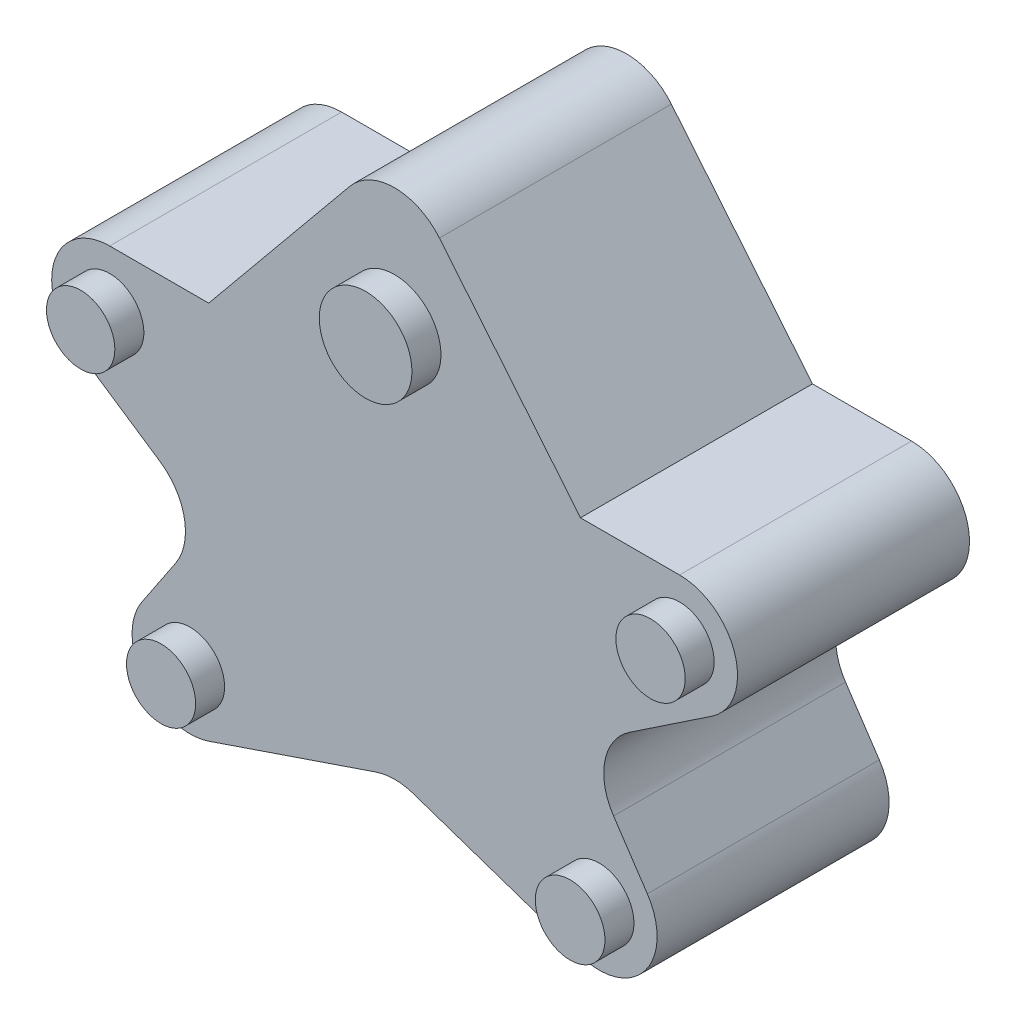
ISO-10303-21;
HEADER;
FILE_DESCRIPTION(('STEP AP214'),'2;1');
FILE_NAME('part.step','',(''),(''),'','','');
FILE_SCHEMA(('AUTOMOTIVE_DESIGN { 1 0 10303 214 1 1 1 1 }'));
ENDSEC;
DATA;
#1=APPLICATION_CONTEXT('core data for automotive mechanical design processes');
#2=APPLICATION_PROTOCOL_DEFINITION('international standard','automotive_design',2000,#1);
#3=PRODUCT_CONTEXT('',#1,'mechanical');
#4=PRODUCT('Part','Part','',(#3));
#5=PRODUCT_RELATED_PRODUCT_CATEGORY('part','',(#4));
#6=PRODUCT_DEFINITION_FORMATION('','',#4);
#7=PRODUCT_DEFINITION_CONTEXT('part definition',#1,'design');
#8=PRODUCT_DEFINITION('design','',#6,#7);
#9=PRODUCT_DEFINITION_SHAPE('','',#8);
#10=(LENGTH_UNIT() NAMED_UNIT(*) SI_UNIT(.MILLI.,.METRE.));
#11=(NAMED_UNIT(*) PLANE_ANGLE_UNIT() SI_UNIT($,.RADIAN.));
#12=(NAMED_UNIT(*) SI_UNIT($,.STERADIAN.) SOLID_ANGLE_UNIT());
#13=UNCERTAINTY_MEASURE_WITH_UNIT(LENGTH_MEASURE(1.E-05),#10,'distance_accuracy_value','');
#14=(GEOMETRIC_REPRESENTATION_CONTEXT(3) GLOBAL_UNCERTAINTY_ASSIGNED_CONTEXT((#13)) GLOBAL_UNIT_ASSIGNED_CONTEXT((#10,
#11,#12)) REPRESENTATION_CONTEXT('',''));
#15=CARTESIAN_POINT('',(0.,0.,0.));
#16=DIRECTION('',(0.,0.,1.));
#17=DIRECTION('',(1.,0.,0.));
#18=AXIS2_PLACEMENT_3D('',#15,#16,#17);
#19=CARTESIAN_POINT('',(10.1618807837349,60.5263157894737,40.));
#20=DIRECTION('',(0.556141389240398,0.831087694033404,0.));
#21=DIRECTION('',(-0.831087694033404,0.556141389240398,0.));
#22=AXIS2_PLACEMENT_3D('',#19,#20,#21);
#23=PLANE('',#22);
#24=DIRECTION('',(0.831087694033404,-0.556141389240398,0.));
#25=VECTOR('',#24,1.);
#26=CARTESIAN_POINT('',(10.1618807837349,60.5263157894737,0.));
#27=LINE('',#26,#25);
#28=CARTESIAN_POINT('',(37.5253260990655,42.2154388491397,0.));
#29=VERTEX_POINT('',#28);
#30=CARTESIAN_POINT('',(51.716265485405,32.7192463274538,0.));
#31=VERTEX_POINT('',#30);
#32=EDGE_CURVE('E205',#29,#31,#27,.T.);
#33=ORIENTED_EDGE('',*,*,#32,.T.);
#34=DIRECTION('',(0.,0.,-1.));
#35=VECTOR('',#34,1.);
#36=CARTESIAN_POINT('',(51.716265485405,32.7192463274538,40.));
#37=LINE('',#36,#35);
#38=CARTESIAN_POINT('',(51.716265485405,32.7192463274538,40.));
#39=VERTEX_POINT('',#38);
#40=EDGE_CURVE('E241',#31,#39,#37,.F.);
#41=ORIENTED_EDGE('',*,*,#40,.T.);
#42=DIRECTION('',(0.831087694033404,-0.556141389240398,0.));
#43=VECTOR('',#42,1.);
#44=CARTESIAN_POINT('',(10.1618807837349,60.5263157894737,40.));
#45=LINE('',#44,#43);
#46=CARTESIAN_POINT('',(37.5253260990655,42.2154388491397,40.));
#47=VERTEX_POINT('',#46);
#48=EDGE_CURVE('E231',#47,#39,#45,.T.);
#49=ORIENTED_EDGE('',*,*,#48,.F.);
#50=DIRECTION('',(0.,0.,-1.));
#51=VECTOR('',#50,1.);
#52=CARTESIAN_POINT('',(37.5253260990655,42.2154388491397,40.));
#53=LINE('',#52,#51);
#54=EDGE_CURVE('E238',#47,#29,#53,.T.);
#55=ORIENTED_EDGE('',*,*,#54,.T.);
#56=EDGE_LOOP('',(#33,#41,#49,#55));
#57=FACE_BOUND('',#56,.T.);
#58=ADVANCED_FACE('F44',(#57),#23,.F.);
#59=CARTESIAN_POINT('',(60.0271424257391,27.1578324350498,40.));
#60=DIRECTION('',(0.831087694033403,-0.556141389240398,0.));
#61=DIRECTION('',(0.556141389240398,0.831087694033403,0.));
#62=AXIS2_PLACEMENT_3D('',#59,#60,#61);
#63=PLANE('',#62);
#64=DIRECTION('',(-0.556141389240398,-0.831087694033403,0.));
#65=VECTOR('',#64,1.);
#66=CARTESIAN_POINT('',(60.0271424257391,27.1578324350498,40.));
#67=LINE('',#66,#65);
#68=CARTESIAN_POINT('',(54.4657285333351,18.8469554947158,40.));
#69=VERTEX_POINT('',#68);
#70=CARTESIAN_POINT('',(48.6398607519713,10.1408834169474,40.));
#71=VERTEX_POINT('',#70);
#72=EDGE_CURVE('E383',#69,#71,#67,.T.);
#73=ORIENTED_EDGE('',*,*,#72,.F.);
#74=DIRECTION('',(0.,0.,-1.));
#75=VECTOR('',#74,1.);
#76=CARTESIAN_POINT('',(54.4657285333351,18.8469554947158,0.));
#77=LINE('',#76,#75);
#78=CARTESIAN_POINT('',(54.4657285333351,18.8469554947158,0.));
#79=VERTEX_POINT('',#78);
#80=EDGE_CURVE('E235',#69,#79,#77,.T.);
#81=ORIENTED_EDGE('',*,*,#80,.T.);
#82=DIRECTION('',(-0.556141389240398,-0.831087694033403,0.));
#83=VECTOR('',#82,1.);
#84=CARTESIAN_POINT('',(60.0271424257391,27.1578324350498,0.));
#85=LINE('',#84,#83);
#86=CARTESIAN_POINT('',(48.6398607519713,10.1408834169474,0.));
#87=VERTEX_POINT('',#86);
#88=EDGE_CURVE('E208',#79,#87,#85,.T.);
#89=ORIENTED_EDGE('',*,*,#88,.T.);
#90=DIRECTION('',(0.,0.,-1.));
#91=VECTOR('',#90,1.);
#92=CARTESIAN_POINT('',(48.6398607519713,10.1408834169474,40.));
#93=LINE('',#92,#91);
#94=EDGE_CURVE('E192',#87,#71,#93,.F.);
#95=ORIENTED_EDGE('',*,*,#94,.T.);
#96=EDGE_LOOP('',(#73,#81,#89,#95));
#97=FACE_BOUND('',#96,.T.);
#98=ADVANCED_FACE('F340',(#97),#63,.F.);
#99=CARTESIAN_POINT('',(32.2200729637191,-14.3965522666203,40.));
#100=DIRECTION('',(-0.322066650937309,0.946716996971125,0.));
#101=DIRECTION('',(-0.946716996971125,-0.322066650937309,0.));
#102=AXIS2_PLACEMENT_3D('',#99,#100,#101);
#103=PLANE('',#102);
#104=DIRECTION('',(0.946716996971125,0.322066650937309,0.));
#105=VECTOR('',#104,1.);
#106=CARTESIAN_POINT('',(32.2200729637191,-14.3965522666203,0.));
#107=LINE('',#106,#105);
#108=CARTESIAN_POINT('',(60.1714042016784,-4.88770044516783,0.));
#109=VERTEX_POINT('',#108);
#110=CARTESIAN_POINT('',(88.9994064543461,4.91938886286649,0.));
#111=VERTEX_POINT('',#110);
#112=EDGE_CURVE('E212',#109,#111,#107,.T.);
#113=ORIENTED_EDGE('',*,*,#112,.T.);
#114=DIRECTION('',(0.,0.,-1.));
#115=VECTOR('',#114,1.);
#116=CARTESIAN_POINT('',(88.999406454346,4.91938886286649,40.));
#117=LINE('',#116,#115);
#118=CARTESIAN_POINT('',(88.9994064543461,4.91938886286649,40.));
#119=VERTEX_POINT('',#118);
#120=EDGE_CURVE('E279',#111,#119,#117,.F.);
#121=ORIENTED_EDGE('',*,*,#120,.T.);
#122=DIRECTION('',(0.946716996971125,0.322066650937309,0.));
#123=VECTOR('',#122,1.);
#124=CARTESIAN_POINT('',(32.2200729637191,-14.3965522666203,40.));
#125=LINE('',#124,#123);
#126=CARTESIAN_POINT('',(60.1714042016784,-4.88770044516783,40.));
#127=VERTEX_POINT('',#126);
#128=EDGE_CURVE('E386',#127,#119,#125,.T.);
#129=ORIENTED_EDGE('',*,*,#128,.F.);
#130=DIRECTION('',(0.,0.,-1.));
#131=VECTOR('',#130,1.);
#132=CARTESIAN_POINT('',(60.1714042016784,-4.88770044516783,40.));
#133=LINE('',#132,#131);
#134=EDGE_CURVE('E276',#127,#109,#133,.T.);
#135=ORIENTED_EDGE('',*,*,#134,.T.);
#136=EDGE_LOOP('',(#113,#121,#129,#135));
#137=FACE_BOUND('',#136,.T.);
#138=ADVANCED_FACE('F345',(#137),#103,.F.);
#139=CARTESIAN_POINT('',(152.220072963719,-14.3965522666202,40.));
#140=DIRECTION('',(0.322066650937308,0.946716996971126,0.));
#141=DIRECTION('',(-0.946716996971126,0.322066650937308,0.));
#142=AXIS2_PLACEMENT_3D('',#139,#140,#141);
#143=PLANE('',#142);
#144=DIRECTION('',(0.946716996971126,-0.322066650937308,0.));
#145=VECTOR('',#144,1.);
#146=CARTESIAN_POINT('',(152.220072963719,-14.3965522666202,0.));
#147=LINE('',#146,#145);
#148=CARTESIAN_POINT('',(95.4407394730922,4.9193888628665,0.));
#149=VERTEX_POINT('',#148);
#150=CARTESIAN_POINT('',(124.26874172576,-4.8877004451678,0.));
#151=VERTEX_POINT('',#150);
#152=EDGE_CURVE('E215',#149,#151,#147,.T.);
#153=ORIENTED_EDGE('',*,*,#152,.T.);
#154=DIRECTION('',(0.,0.,-1.));
#155=VECTOR('',#154,1.);
#156=CARTESIAN_POINT('',(124.26874172576,-4.8877004451678,40.));
#157=LINE('',#156,#155);
#158=CARTESIAN_POINT('',(124.26874172576,-4.8877004451678,40.));
#159=VERTEX_POINT('',#158);
#160=EDGE_CURVE('E266',#151,#159,#157,.F.);
#161=ORIENTED_EDGE('',*,*,#160,.T.);
#162=DIRECTION('',(0.946716996971126,-0.322066650937308,0.));
#163=VECTOR('',#162,1.);
#164=CARTESIAN_POINT('',(152.220072963719,-14.3965522666202,40.));
#165=LINE('',#164,#163);
#166=CARTESIAN_POINT('',(95.4407394730922,4.9193888628665,40.));
#167=VERTEX_POINT('',#166);
#168=EDGE_CURVE('E393',#167,#159,#165,.T.);
#169=ORIENTED_EDGE('',*,*,#168,.F.);
#170=DIRECTION('',(0.,0.,-1.));
#171=VECTOR('',#170,1.);
#172=CARTESIAN_POINT('',(95.4407394730922,4.91938886286649,0.));
#173=LINE('',#172,#171);
#174=EDGE_CURVE('E263',#167,#149,#173,.T.);
#175=ORIENTED_EDGE('',*,*,#174,.T.);
#176=EDGE_LOOP('',(#153,#161,#169,#175));
#177=FACE_BOUND('',#176,.T.);
#178=ADVANCED_FACE('F428',(#177),#143,.F.);
#179=CARTESIAN_POINT('',(124.413003501699,27.1578324350499,40.));
#180=DIRECTION('',(-0.831087694033403,-0.556141389240399,0.));
#181=DIRECTION('',(0.556141389240399,-0.831087694033403,0.));
#182=AXIS2_PLACEMENT_3D('',#179,#180,#181);
#183=PLANE('',#182);
#184=DIRECTION('',(-0.556141389240399,0.831087694033403,0.));
#185=VECTOR('',#184,1.);
#186=CARTESIAN_POINT('',(124.413003501699,27.1578324350499,0.));
#187=LINE('',#186,#185);
#188=CARTESIAN_POINT('',(135.800285175467,10.1408834169474,0.));
#189=VERTEX_POINT('',#188);
#190=CARTESIAN_POINT('',(129.974417394103,18.8469554947159,0.));
#191=VERTEX_POINT('',#190);
#192=EDGE_CURVE('E218',#189,#191,#187,.T.);
#193=ORIENTED_EDGE('',*,*,#192,.T.);
#194=DIRECTION('',(0.,0.,-1.));
#195=VECTOR('',#194,1.);
#196=CARTESIAN_POINT('',(129.974417394103,18.8469554947158,40.));
#197=LINE('',#196,#195);
#198=CARTESIAN_POINT('',(129.974417394103,18.8469554947159,40.));
#199=VERTEX_POINT('',#198);
#200=EDGE_CURVE('E251',#191,#199,#197,.F.);
#201=ORIENTED_EDGE('',*,*,#200,.T.);
#202=DIRECTION('',(-0.556141389240399,0.831087694033403,0.));
#203=VECTOR('',#202,1.);
#204=CARTESIAN_POINT('',(124.413003501699,27.1578324350499,40.));
#205=LINE('',#204,#203);
#206=CARTESIAN_POINT('',(135.800285175467,10.1408834169474,40.));
#207=VERTEX_POINT('',#206);
#208=EDGE_CURVE('E395',#207,#199,#205,.T.);
#209=ORIENTED_EDGE('',*,*,#208,.F.);
#210=DIRECTION('',(0.,0.,-1.));
#211=VECTOR('',#210,1.);
#212=CARTESIAN_POINT('',(135.800285175467,10.1408834169474,40.));
#213=LINE('',#212,#211);
#214=EDGE_CURVE('E248',#207,#189,#213,.T.);
#215=ORIENTED_EDGE('',*,*,#214,.T.);
#216=EDGE_LOOP('',(#193,#201,#209,#215));
#217=FACE_BOUND('',#216,.T.);
#218=ADVANCED_FACE('F425',(#217),#183,.F.);
#219=CARTESIAN_POINT('',(174.278265143703,60.5263157894737,40.));
#220=DIRECTION('',(-0.556141389240398,0.831087694033404,0.));
#221=DIRECTION('',(-0.831087694033404,-0.556141389240398,0.));
#222=AXIS2_PLACEMENT_3D('',#219,#220,#221);
#223=PLANE('',#222);
#224=DIRECTION('',(0.831087694033404,0.556141389240398,0.));
#225=VECTOR('',#224,1.);
#226=CARTESIAN_POINT('',(174.278265143703,60.5263157894737,40.));
#227=LINE('',#226,#225);
#228=CARTESIAN_POINT('',(132.723880442033,32.7192463274539,40.));
#229=VERTEX_POINT('',#228);
#230=CARTESIAN_POINT('',(146.914819828373,42.2154388491397,40.));
#231=VERTEX_POINT('',#230);
#232=EDGE_CURVE('E182',#229,#231,#227,.T.);
#233=ORIENTED_EDGE('',*,*,#232,.F.);
#234=DIRECTION('',(0.,0.,-1.));
#235=VECTOR('',#234,1.);
#236=CARTESIAN_POINT('',(132.723880442033,32.7192463274539,0.));
#237=LINE('',#236,#235);
#238=CARTESIAN_POINT('',(132.723880442033,32.7192463274539,0.));
#239=VERTEX_POINT('',#238);
#240=EDGE_CURVE('E245',#229,#239,#237,.T.);
#241=ORIENTED_EDGE('',*,*,#240,.T.);
#242=DIRECTION('',(0.831087694033404,0.556141389240398,0.));
#243=VECTOR('',#242,1.);
#244=CARTESIAN_POINT('',(174.278265143703,60.5263157894737,0.));
#245=LINE('',#244,#243);
#246=CARTESIAN_POINT('',(146.914819828373,42.2154388491397,0.));
#247=VERTEX_POINT('',#246);
#248=EDGE_CURVE('E221',#239,#247,#245,.T.);
#249=ORIENTED_EDGE('',*,*,#248,.T.);
#250=DIRECTION('',(0.,0.,-1.));
#251=VECTOR('',#250,1.);
#252=CARTESIAN_POINT('',(146.914819828373,42.2154388491397,40.));
#253=LINE('',#252,#251);
#254=EDGE_CURVE('E243',#247,#231,#253,.F.);
#255=ORIENTED_EDGE('',*,*,#254,.T.);
#256=EDGE_LOOP('',(#233,#241,#249,#255));
#257=FACE_BOUND('',#256,.T.);
#258=ADVANCED_FACE('F422',(#257),#223,.F.);
#259=CARTESIAN_POINT('',(174.278265143703,60.5263157894737,40.));
#260=DIRECTION('',(0.,-1.,0.));
#261=DIRECTION('',(0.,0.,-1.));
#262=AXIS2_PLACEMENT_3D('',#259,#260,#261);
#263=PLANE('',#262);
#264=DIRECTION('',(-1.,0.,0.));
#265=VECTOR('',#264,1.);
#266=CARTESIAN_POINT('',(174.278265143703,60.5263157894737,40.));
#267=LINE('',#266,#265);
#268=CARTESIAN_POINT('',(141.353405935969,60.5263157894737,40.));
#269=VERTEX_POINT('',#268);
#270=CARTESIAN_POINT('',(124.278265143703,60.5263157894737,40.));
#271=VERTEX_POINT('',#270);
#272=EDGE_CURVE('E170',#269,#271,#267,.T.);
#273=ORIENTED_EDGE('',*,*,#272,.F.);
#274=DIRECTION('',(0.,0.,-1.));
#275=VECTOR('',#274,1.);
#276=CARTESIAN_POINT('',(141.353405935969,60.5263157894737,40.));
#277=LINE('',#276,#275);
#278=CARTESIAN_POINT('',(141.353405935969,60.5263157894737,0.));
#279=VERTEX_POINT('',#278);
#280=EDGE_CURVE('E286',#269,#279,#277,.T.);
#281=ORIENTED_EDGE('',*,*,#280,.T.);
#282=DIRECTION('',(-1.,0.,0.));
#283=VECTOR('',#282,1.);
#284=CARTESIAN_POINT('',(174.278265143703,60.5263157894737,0.));
#285=LINE('',#284,#283);
#286=CARTESIAN_POINT('',(124.278265143703,60.5263157894737,0.));
#287=VERTEX_POINT('',#286);
#288=EDGE_CURVE('E188',#279,#287,#285,.T.);
#289=ORIENTED_EDGE('',*,*,#288,.T.);
#290=DIRECTION('',(0.,0.,-1.));
#291=VECTOR('',#290,1.);
#292=CARTESIAN_POINT('',(124.278265143703,60.5263157894737,40.));
#293=LINE('',#292,#291);
#294=EDGE_CURVE('E185',#271,#287,#293,.T.);
#295=ORIENTED_EDGE('',*,*,#294,.F.);
#296=EDGE_LOOP('',(#273,#281,#289,#295));
#297=FACE_BOUND('',#296,.T.);
#298=ADVANCED_FACE('F186',(#297),#263,.F.);
#299=CARTESIAN_POINT('',(124.278265143703,60.5263157894737,40.));
#300=DIRECTION('',(-0.772612302711674,-0.634878121924645,0.));
#301=DIRECTION('',(0.634878121924645,-0.772612302711674,0.));
#302=AXIS2_PLACEMENT_3D('',#299,#300,#301);
#303=PLANE('',#302);
#304=DIRECTION('',(-0.634878121924645,0.772612302711674,0.));
#305=VECTOR('',#304,1.);
#306=CARTESIAN_POINT('',(124.278265143703,60.5263157894737,0.));
#307=LINE('',#306,#305);
#308=CARTESIAN_POINT('',(99.9461959908359,90.1371266344693,0.));
#309=VERTEX_POINT('',#308);
#310=EDGE_CURVE('E225',#287,#309,#307,.T.);
#311=ORIENTED_EDGE('',*,*,#310,.T.);
#312=DIRECTION('',(0.,0.,-1.));
#313=VECTOR('',#312,1.);
#314=CARTESIAN_POINT('',(99.9461959908359,90.1371266344693,40.));
#315=LINE('',#314,#313);
#316=CARTESIAN_POINT('',(99.9461959908359,90.1371266344693,40.));
#317=VERTEX_POINT('',#316);
#318=EDGE_CURVE('E197',#309,#317,#315,.F.);
#319=ORIENTED_EDGE('',*,*,#318,.T.);
#320=DIRECTION('',(-0.634878121924645,0.772612302711674,0.));
#321=VECTOR('',#320,1.);
#322=CARTESIAN_POINT('',(124.278265143703,60.5263157894737,40.));
#323=LINE('',#322,#321);
#324=EDGE_CURVE('E175',#271,#317,#323,.T.);
#325=ORIENTED_EDGE('',*,*,#324,.F.);
#326=ORIENTED_EDGE('',*,*,#294,.T.);
#327=EDGE_LOOP('',(#311,#319,#325,#326));
#328=FACE_BOUND('',#327,.T.);
#329=ADVANCED_FACE('F195',(#328),#303,.F.);
#330=CARTESIAN_POINT('',(60.1618807837349,60.5263157894737,40.));
#331=DIRECTION('',(0.772612302711674,-0.634878121924645,0.));
#332=DIRECTION('',(0.634878121924645,0.772612302711675,0.));
#333=AXIS2_PLACEMENT_3D('',#330,#331,#332);
#334=PLANE('',#333);
#335=DIRECTION('',(-0.634878121924645,-0.772612302711674,0.));
#336=VECTOR('',#335,1.);
#337=CARTESIAN_POINT('',(60.1618807837349,60.5263157894737,40.));
#338=LINE('',#337,#336);
#339=CARTESIAN_POINT('',(84.4939499366024,90.1371266344693,40.));
#340=VERTEX_POINT('',#339);
#341=CARTESIAN_POINT('',(60.1618807837349,60.5263157894737,40.));
#342=VERTEX_POINT('',#341);
#343=EDGE_CURVE('E198',#340,#342,#338,.T.);
#344=ORIENTED_EDGE('',*,*,#343,.F.);
#345=DIRECTION('',(0.,0.,-1.));
#346=VECTOR('',#345,1.);
#347=CARTESIAN_POINT('',(84.4939499366024,90.1371266344693,40.));
#348=LINE('',#347,#346);
#349=CARTESIAN_POINT('',(84.4939499366024,90.1371266344693,0.));
#350=VERTEX_POINT('',#349);
#351=EDGE_CURVE('E281',#340,#350,#348,.T.);
#352=ORIENTED_EDGE('',*,*,#351,.T.);
#353=DIRECTION('',(-0.634878121924645,-0.772612302711674,0.));
#354=VECTOR('',#353,1.);
#355=CARTESIAN_POINT('',(60.1618807837349,60.5263157894737,0.));
#356=LINE('',#355,#354);
#357=CARTESIAN_POINT('',(60.1618807837349,60.5263157894737,0.));
#358=VERTEX_POINT('',#357);
#359=EDGE_CURVE('E227',#350,#358,#356,.T.);
#360=ORIENTED_EDGE('',*,*,#359,.T.);
#361=DIRECTION('',(0.,0.,-1.));
#362=VECTOR('',#361,1.);
#363=CARTESIAN_POINT('',(60.1618807837349,60.5263157894737,40.));
#364=LINE('',#363,#362);
#365=EDGE_CURVE('E193',#342,#358,#364,.T.);
#366=ORIENTED_EDGE('',*,*,#365,.F.);
#367=EDGE_LOOP('',(#344,#352,#360,#366));
#368=FACE_BOUND('',#367,.T.);
#369=ADVANCED_FACE('F408',(#368),#334,.F.);
#370=CARTESIAN_POINT('',(10.1618807837349,60.5263157894737,40.));
#371=DIRECTION('',(0.,-1.,0.));
#372=DIRECTION('',(0.,0.,-1.));
#373=AXIS2_PLACEMENT_3D('',#370,#371,#372);
#374=PLANE('',#373);
#375=DIRECTION('',(-1.,0.,0.));
#376=VECTOR('',#375,1.);
#377=CARTESIAN_POINT('',(10.1618807837349,60.5263157894737,0.));
#378=LINE('',#377,#376);
#379=CARTESIAN_POINT('',(43.0867399914695,60.5263157894737,0.));
#380=VERTEX_POINT('',#379);
#381=EDGE_CURVE('E229',#358,#380,#378,.T.);
#382=ORIENTED_EDGE('',*,*,#381,.T.);
#383=DIRECTION('',(0.,0.,-1.));
#384=VECTOR('',#383,1.);
#385=CARTESIAN_POINT('',(43.0867399914695,60.5263157894737,40.));
#386=LINE('',#385,#384);
#387=CARTESIAN_POINT('',(43.0867399914695,60.5263157894737,40.));
#388=VERTEX_POINT('',#387);
#389=EDGE_CURVE('E59',#380,#388,#386,.F.);
#390=ORIENTED_EDGE('',*,*,#389,.T.);
#391=DIRECTION('',(-1.,0.,0.));
#392=VECTOR('',#391,1.);
#393=CARTESIAN_POINT('',(10.1618807837349,60.5263157894737,40.));
#394=LINE('',#393,#392);
#395=EDGE_CURVE('E200',#342,#388,#394,.T.);
#396=ORIENTED_EDGE('',*,*,#395,.F.);
#397=ORIENTED_EDGE('',*,*,#365,.T.);
#398=EDGE_LOOP('',(#382,#390,#396,#397));
#399=FACE_BOUND('',#398,.T.);
#400=ADVANCED_FACE('F316',(#399),#374,.F.);
#401=CARTESIAN_POINT('',(0.,0.,40.));
#402=DIRECTION('',(0.,0.,-1.));
#403=DIRECTION('',(-1.,0.,0.));
#404=AXIS2_PLACEMENT_3D('',#401,#402,#403);
#405=PLANE('',#404);
#406=CARTESIAN_POINT('',(141.353405935969,50.5263157894737,40.));
#407=DIRECTION('',(0.,0.,-1.));
#408=DIRECTION('',(-1.,0.,0.));
#409=AXIS2_PLACEMENT_3D('',#406,#407,#408);
#410=CIRCLE('',#409,5.97250261311214);
#411=CARTESIAN_POINT('',(135.380903322857,50.5263157894737,40.));
#412=VERTEX_POINT('',#411);
#413=EDGE_CURVE('E11',#412,#412,#410,.F.);
#414=ORIENTED_EDGE('',*,*,#413,.F.);
#415=EDGE_LOOP('',(#414));
#416=FACE_BOUND('',#415,.T.);
#417=CARTESIAN_POINT('',(127.489408235133,4.57946952454346,40.));
#418=DIRECTION('',(0.,0.,-1.));
#419=DIRECTION('',(-1.,0.,0.));
#420=AXIS2_PLACEMENT_3D('',#417,#418,#419);
#421=CIRCLE('',#420,6.00371098317974);
#422=CARTESIAN_POINT('',(121.485697251953,4.57946952454346,40.));
#423=VERTEX_POINT('',#422);
#424=EDGE_CURVE('E52',#423,#423,#421,.F.);
#425=ORIENTED_EDGE('',*,*,#424,.F.);
#426=EDGE_LOOP('',(#425));
#427=FACE_BOUND('',#426,.T.);
#428=CARTESIAN_POINT('',(56.9507376923053,4.57946952454342,40.));
#429=DIRECTION('',(0.,0.,-1.));
#430=DIRECTION('',(-1.,0.,0.));
#431=AXIS2_PLACEMENT_3D('',#428,#429,#430);
#432=CIRCLE('',#431,5.96031223145166);
#433=CARTESIAN_POINT('',(50.9904254608536,4.57946952454342,40.));
#434=VERTEX_POINT('',#433);
#435=EDGE_CURVE('E306',#434,#434,#432,.F.);
#436=ORIENTED_EDGE('',*,*,#435,.F.);
#437=EDGE_LOOP('',(#436));
#438=FACE_BOUND('',#437,.T.);
#439=CARTESIAN_POINT('',(43.0867399914695,50.5263157894737,40.));
#440=DIRECTION('',(0.,0.,-1.));
#441=DIRECTION('',(-1.,0.,0.));
#442=AXIS2_PLACEMENT_3D('',#439,#440,#441);
#443=CIRCLE('',#442,5.89290395480697);
#444=CARTESIAN_POINT('',(37.1938360366625,50.5263157894737,40.));
#445=VERTEX_POINT('',#444);
#446=EDGE_CURVE('E303',#445,#445,#443,.F.);
#447=ORIENTED_EDGE('',*,*,#446,.F.);
#448=EDGE_LOOP('',(#447));
#449=FACE_BOUND('',#448,.T.);
#450=CARTESIAN_POINT('',(92.2200729637191,72.8316464568177,40.));
#451=DIRECTION('',(0.,0.,-1.));
#452=DIRECTION('',(-1.,0.,0.));
#453=AXIS2_PLACEMENT_3D('',#450,#451,#452);
#454=CIRCLE('',#453,7.98956415539784);
#455=CARTESIAN_POINT('',(84.2305088083213,72.8316464568177,40.));
#456=VERTEX_POINT('',#455);
#457=EDGE_CURVE('E300',#456,#456,#454,.F.);
#458=ORIENTED_EDGE('',*,*,#457,.F.);
#459=EDGE_LOOP('',(#458));
#460=FACE_BOUND('',#459,.T.);
#461=ORIENTED_EDGE('',*,*,#168,.T.);
#462=CARTESIAN_POINT('',(127.489408235133,4.57946952454346,40.));
#463=DIRECTION('',(0.,0.,-1.));
#464=DIRECTION('',(-1.,0.,0.));
#465=AXIS2_PLACEMENT_3D('',#462,#463,#464);
#466=CIRCLE('',#465,10.);
#467=EDGE_CURVE('E274',#159,#207,#466,.F.);
#468=ORIENTED_EDGE('',*,*,#467,.T.);
#469=ORIENTED_EDGE('',*,*,#208,.T.);
#470=CARTESIAN_POINT('',(138.285294334437,24.4083693871198,40.));
#471=DIRECTION('',(0.,0.,-1.));
#472=DIRECTION('',(-1.,0.,0.));
#473=AXIS2_PLACEMENT_3D('',#470,#471,#472);
#474=CIRCLE('',#473,10.);
#475=EDGE_CURVE('E294',#199,#229,#474,.T.);
#476=ORIENTED_EDGE('',*,*,#475,.T.);
#477=ORIENTED_EDGE('',*,*,#232,.T.);
#478=CARTESIAN_POINT('',(141.353405935969,50.5263157894737,40.));
#479=DIRECTION('',(0.,0.,-1.));
#480=DIRECTION('',(-1.,0.,0.));
#481=AXIS2_PLACEMENT_3D('',#478,#479,#480);
#482=CIRCLE('',#481,10.);
#483=EDGE_CURVE('E178',#231,#269,#482,.F.);
#484=ORIENTED_EDGE('',*,*,#483,.T.);
#485=ORIENTED_EDGE('',*,*,#272,.T.);
#486=ORIENTED_EDGE('',*,*,#324,.T.);
#487=CARTESIAN_POINT('',(92.2200729637191,83.7883454152228,40.));
#488=DIRECTION('',(0.,0.,-1.));
#489=DIRECTION('',(-1.,0.,0.));
#490=AXIS2_PLACEMENT_3D('',#487,#488,#489);
#491=CIRCLE('',#490,10.);
#492=EDGE_CURVE('E67',#317,#340,#491,.F.);
#493=ORIENTED_EDGE('',*,*,#492,.T.);
#494=ORIENTED_EDGE('',*,*,#343,.T.);
#495=ORIENTED_EDGE('',*,*,#395,.T.);
#496=CARTESIAN_POINT('',(43.0867399914695,50.5263157894737,40.));
#497=DIRECTION('',(0.,0.,-1.));
#498=DIRECTION('',(-1.,0.,0.));
#499=AXIS2_PLACEMENT_3D('',#496,#497,#498);
#500=CIRCLE('',#499,10.);
#501=EDGE_CURVE('E269',#388,#47,#500,.F.);
#502=ORIENTED_EDGE('',*,*,#501,.T.);
#503=ORIENTED_EDGE('',*,*,#48,.T.);
#504=CARTESIAN_POINT('',(46.154851593001,24.4083693871198,40.));
#505=DIRECTION('',(0.,0.,-1.));
#506=DIRECTION('',(-1.,0.,0.));
#507=AXIS2_PLACEMENT_3D('',#504,#505,#506);
#508=CIRCLE('',#507,10.);
#509=EDGE_CURVE('E290',#39,#69,#508,.T.);
#510=ORIENTED_EDGE('',*,*,#509,.T.);
#511=ORIENTED_EDGE('',*,*,#72,.T.);
#512=CARTESIAN_POINT('',(56.9507376923053,4.57946952454342,40.));
#513=DIRECTION('',(0.,0.,-1.));
#514=DIRECTION('',(-1.,0.,0.));
#515=AXIS2_PLACEMENT_3D('',#512,#513,#514);
#516=CIRCLE('',#515,10.);
#517=EDGE_CURVE('E272',#71,#127,#516,.F.);
#518=ORIENTED_EDGE('',*,*,#517,.T.);
#519=ORIENTED_EDGE('',*,*,#128,.T.);
#520=CARTESIAN_POINT('',(92.2200729637191,-4.54778110684477,40.));
#521=DIRECTION('',(0.,0.,-1.));
#522=DIRECTION('',(-1.,0.,0.));
#523=AXIS2_PLACEMENT_3D('',#520,#521,#522);
#524=CIRCLE('',#523,10.);
#525=EDGE_CURVE('E298',#119,#167,#524,.T.);
#526=ORIENTED_EDGE('',*,*,#525,.T.);
#527=EDGE_LOOP('',(#461,#468,#469,#476,#477,#484,#485,#486,#493,#494,#495,#502,#503,#510,#511,
#518,#519,#526));
#528=FACE_BOUND('',#527,.T.);
#529=ADVANCED_FACE('F173',(#416,#427,#438,#449,#460,#528),#405,.F.);
#530=CARTESIAN_POINT('',(0.,0.,0.));
#531=DIRECTION('',(0.,0.,-1.));
#532=DIRECTION('',(-1.,0.,0.));
#533=AXIS2_PLACEMENT_3D('',#530,#531,#532);
#534=PLANE('',#533);
#535=ORIENTED_EDGE('',*,*,#192,.F.);
#536=CARTESIAN_POINT('',(127.489408235133,4.57946952454346,0.));
#537=DIRECTION('',(0.,0.,-1.));
#538=DIRECTION('',(-1.,0.,0.));
#539=AXIS2_PLACEMENT_3D('',#536,#537,#538);
#540=CIRCLE('',#539,10.);
#541=EDGE_CURVE('E261',#189,#151,#540,.T.);
#542=ORIENTED_EDGE('',*,*,#541,.T.);
#543=ORIENTED_EDGE('',*,*,#152,.F.);
#544=CARTESIAN_POINT('',(92.2200729637191,-4.54778110684477,0.));
#545=DIRECTION('',(0.,0.,-1.));
#546=DIRECTION('',(-1.,0.,0.));
#547=AXIS2_PLACEMENT_3D('',#544,#545,#546);
#548=CIRCLE('',#547,10.);
#549=EDGE_CURVE('E296',#149,#111,#548,.F.);
#550=ORIENTED_EDGE('',*,*,#549,.T.);
#551=ORIENTED_EDGE('',*,*,#112,.F.);
#552=CARTESIAN_POINT('',(56.9507376923053,4.57946952454342,0.));
#553=DIRECTION('',(0.,0.,-1.));
#554=DIRECTION('',(-1.,0.,0.));
#555=AXIS2_PLACEMENT_3D('',#552,#553,#554);
#556=CIRCLE('',#555,10.);
#557=EDGE_CURVE('E259',#109,#87,#556,.T.);
#558=ORIENTED_EDGE('',*,*,#557,.T.);
#559=ORIENTED_EDGE('',*,*,#88,.F.);
#560=CARTESIAN_POINT('',(46.154851593001,24.4083693871198,0.));
#561=DIRECTION('',(0.,0.,-1.));
#562=DIRECTION('',(-1.,0.,0.));
#563=AXIS2_PLACEMENT_3D('',#560,#561,#562);
#564=CIRCLE('',#563,10.);
#565=EDGE_CURVE('E288',#79,#31,#564,.F.);
#566=ORIENTED_EDGE('',*,*,#565,.T.);
#567=ORIENTED_EDGE('',*,*,#32,.F.);
#568=CARTESIAN_POINT('',(43.0867399914695,50.5263157894737,0.));
#569=DIRECTION('',(0.,0.,-1.));
#570=DIRECTION('',(-1.,0.,0.));
#571=AXIS2_PLACEMENT_3D('',#568,#569,#570);
#572=CIRCLE('',#571,10.);
#573=EDGE_CURVE('E255',#29,#380,#572,.T.);
#574=ORIENTED_EDGE('',*,*,#573,.T.);
#575=ORIENTED_EDGE('',*,*,#381,.F.);
#576=ORIENTED_EDGE('',*,*,#359,.F.);
#577=CARTESIAN_POINT('',(92.2200729637191,83.7883454152228,0.));
#578=DIRECTION('',(0.,0.,-1.));
#579=DIRECTION('',(-1.,0.,0.));
#580=AXIS2_PLACEMENT_3D('',#577,#578,#579);
#581=CIRCLE('',#580,10.);
#582=EDGE_CURVE('E257',#350,#309,#581,.T.);
#583=ORIENTED_EDGE('',*,*,#582,.T.);
#584=ORIENTED_EDGE('',*,*,#310,.F.);
#585=ORIENTED_EDGE('',*,*,#288,.F.);
#586=CARTESIAN_POINT('',(141.353405935969,50.5263157894737,0.));
#587=DIRECTION('',(0.,0.,-1.));
#588=DIRECTION('',(-1.,0.,0.));
#589=AXIS2_PLACEMENT_3D('',#586,#587,#588);
#590=CIRCLE('',#589,10.);
#591=EDGE_CURVE('E253',#279,#247,#590,.T.);
#592=ORIENTED_EDGE('',*,*,#591,.T.);
#593=ORIENTED_EDGE('',*,*,#248,.F.);
#594=CARTESIAN_POINT('',(138.285294334437,24.4083693871198,0.));
#595=DIRECTION('',(0.,0.,-1.));
#596=DIRECTION('',(-1.,0.,0.));
#597=AXIS2_PLACEMENT_3D('',#594,#595,#596);
#598=CIRCLE('',#597,10.);
#599=EDGE_CURVE('E292',#239,#191,#598,.F.);
#600=ORIENTED_EDGE('',*,*,#599,.T.);
#601=EDGE_LOOP('',(#535,#542,#543,#550,#551,#558,#559,#566,#567,#574,#575,#576,#583,#584,#585,
#592,#593,#600));
#602=FACE_BOUND('',#601,.T.);
#603=ADVANCED_FACE('F315',(#602),#534,.T.);
#604=CARTESIAN_POINT('',(46.154851593001,24.4083693871198,40.));
#605=DIRECTION('',(0.,0.,1.));
#606=DIRECTION('',(1.,0.,0.));
#607=AXIS2_PLACEMENT_3D('',#604,#605,#606);
#608=CYLINDRICAL_SURFACE('',#607,10.);
#609=ORIENTED_EDGE('',*,*,#509,.F.);
#610=ORIENTED_EDGE('',*,*,#40,.F.);
#611=ORIENTED_EDGE('',*,*,#565,.F.);
#612=ORIENTED_EDGE('',*,*,#80,.F.);
#613=EDGE_LOOP('',(#609,#610,#611,#612));
#614=FACE_BOUND('',#613,.T.);
#615=ADVANCED_FACE('F350',(#614),#608,.F.);
#616=CARTESIAN_POINT('',(138.285294334437,24.4083693871198,40.));
#617=DIRECTION('',(0.,0.,1.));
#618=DIRECTION('',(1.,0.,0.));
#619=AXIS2_PLACEMENT_3D('',#616,#617,#618);
#620=CYLINDRICAL_SURFACE('',#619,10.);
#621=ORIENTED_EDGE('',*,*,#475,.F.);
#622=ORIENTED_EDGE('',*,*,#200,.F.);
#623=ORIENTED_EDGE('',*,*,#599,.F.);
#624=ORIENTED_EDGE('',*,*,#240,.F.);
#625=EDGE_LOOP('',(#621,#622,#623,#624));
#626=FACE_BOUND('',#625,.T.);
#627=ADVANCED_FACE('F353',(#626),#620,.F.);
#628=CARTESIAN_POINT('',(127.489408235133,4.57946952454346,40.));
#629=DIRECTION('',(0.,0.,-1.));
#630=DIRECTION('',(-1.,0.,0.));
#631=AXIS2_PLACEMENT_3D('',#628,#629,#630);
#632=CYLINDRICAL_SURFACE('',#631,10.);
#633=ORIENTED_EDGE('',*,*,#467,.F.);
#634=ORIENTED_EDGE('',*,*,#160,.F.);
#635=ORIENTED_EDGE('',*,*,#541,.F.);
#636=ORIENTED_EDGE('',*,*,#214,.F.);
#637=EDGE_LOOP('',(#633,#634,#635,#636));
#638=FACE_BOUND('',#637,.T.);
#639=ADVANCED_FACE('F357',(#638),#632,.T.);
#640=CARTESIAN_POINT('',(92.2200729637191,-4.54778110684477,40.));
#641=DIRECTION('',(0.,0.,1.));
#642=DIRECTION('',(1.,0.,0.));
#643=AXIS2_PLACEMENT_3D('',#640,#641,#642);
#644=CYLINDRICAL_SURFACE('',#643,10.);
#645=ORIENTED_EDGE('',*,*,#525,.F.);
#646=ORIENTED_EDGE('',*,*,#120,.F.);
#647=ORIENTED_EDGE('',*,*,#549,.F.);
#648=ORIENTED_EDGE('',*,*,#174,.F.);
#649=EDGE_LOOP('',(#645,#646,#647,#648));
#650=FACE_BOUND('',#649,.T.);
#651=ADVANCED_FACE('F361',(#650),#644,.F.);
#652=CARTESIAN_POINT('',(56.9507376923053,4.57946952454342,40.));
#653=DIRECTION('',(0.,0.,-1.));
#654=DIRECTION('',(-1.,0.,0.));
#655=AXIS2_PLACEMENT_3D('',#652,#653,#654);
#656=CYLINDRICAL_SURFACE('',#655,10.);
#657=ORIENTED_EDGE('',*,*,#517,.F.);
#658=ORIENTED_EDGE('',*,*,#94,.F.);
#659=ORIENTED_EDGE('',*,*,#557,.F.);
#660=ORIENTED_EDGE('',*,*,#134,.F.);
#661=EDGE_LOOP('',(#657,#658,#659,#660));
#662=FACE_BOUND('',#661,.T.);
#663=ADVANCED_FACE('F365',(#662),#656,.T.);
#664=CARTESIAN_POINT('',(92.2200729637191,83.7883454152228,40.));
#665=DIRECTION('',(0.,0.,-1.));
#666=DIRECTION('',(-1.,0.,0.));
#667=AXIS2_PLACEMENT_3D('',#664,#665,#666);
#668=CYLINDRICAL_SURFACE('',#667,10.);
#669=ORIENTED_EDGE('',*,*,#492,.F.);
#670=ORIENTED_EDGE('',*,*,#318,.F.);
#671=ORIENTED_EDGE('',*,*,#582,.F.);
#672=ORIENTED_EDGE('',*,*,#351,.F.);
#673=EDGE_LOOP('',(#669,#670,#671,#672));
#674=FACE_BOUND('',#673,.T.);
#675=ADVANCED_FACE('F369',(#674),#668,.T.);
#676=CARTESIAN_POINT('',(43.0867399914695,50.5263157894737,40.));
#677=DIRECTION('',(0.,0.,-1.));
#678=DIRECTION('',(-1.,0.,0.));
#679=AXIS2_PLACEMENT_3D('',#676,#677,#678);
#680=CYLINDRICAL_SURFACE('',#679,10.);
#681=ORIENTED_EDGE('',*,*,#501,.F.);
#682=ORIENTED_EDGE('',*,*,#389,.F.);
#683=ORIENTED_EDGE('',*,*,#573,.F.);
#684=ORIENTED_EDGE('',*,*,#54,.F.);
#685=EDGE_LOOP('',(#681,#682,#683,#684));
#686=FACE_BOUND('',#685,.T.);
#687=ADVANCED_FACE('F336',(#686),#680,.T.);
#688=CARTESIAN_POINT('',(141.353405935969,50.5263157894737,40.));
#689=DIRECTION('',(0.,0.,-1.));
#690=DIRECTION('',(-1.,0.,0.));
#691=AXIS2_PLACEMENT_3D('',#688,#689,#690);
#692=CYLINDRICAL_SURFACE('',#691,10.);
#693=ORIENTED_EDGE('',*,*,#483,.F.);
#694=ORIENTED_EDGE('',*,*,#254,.F.);
#695=ORIENTED_EDGE('',*,*,#591,.F.);
#696=ORIENTED_EDGE('',*,*,#280,.F.);
#697=EDGE_LOOP('',(#693,#694,#695,#696));
#698=FACE_BOUND('',#697,.T.);
#699=ADVANCED_FACE('F46',(#698),#692,.T.);
#700=CARTESIAN_POINT('',(92.2200729637191,72.8316464568177,45.));
#701=DIRECTION('',(0.,0.,-1.));
#702=DIRECTION('',(-1.,0.,0.));
#703=AXIS2_PLACEMENT_3D('',#700,#701,#702);
#704=CYLINDRICAL_SURFACE('',#703,7.98956415539784);
#705=CARTESIAN_POINT('',(92.2200729637191,72.8316464568177,45.));
#706=DIRECTION('',(0.,0.,1.));
#707=DIRECTION('',(1.,0.,0.));
#708=AXIS2_PLACEMENT_3D('',#705,#706,#707);
#709=CIRCLE('',#708,7.98956415539784);
#710=CARTESIAN_POINT('',(100.209637119117,72.8316464568177,45.));
#711=VERTEX_POINT('',#710);
#712=EDGE_CURVE('E209',#711,#711,#709,.T.);
#713=ORIENTED_EDGE('',*,*,#712,.F.);
#714=EDGE_LOOP('',(#713));
#715=FACE_BOUND('',#714,.T.);
#716=ORIENTED_EDGE('',*,*,#457,.T.);
#717=EDGE_LOOP('',(#716));
#718=FACE_BOUND('',#717,.T.);
#719=ADVANCED_FACE('F325',(#715,#718),#704,.T.);
#720=CARTESIAN_POINT('',(92.2200729637191,72.8316464568177,45.));
#721=DIRECTION('',(0.,0.,1.));
#722=DIRECTION('',(1.,0.,0.));
#723=AXIS2_PLACEMENT_3D('',#720,#721,#722);
#724=PLANE('',#723);
#725=ORIENTED_EDGE('',*,*,#712,.T.);
#726=EDGE_LOOP('',(#725));
#727=FACE_BOUND('',#726,.T.);
#728=ADVANCED_FACE('F327',(#727),#724,.T.);
#729=CARTESIAN_POINT('',(43.0867399914695,50.5263157894737,45.));
#730=DIRECTION('',(0.,0.,-1.));
#731=DIRECTION('',(-1.,0.,0.));
#732=AXIS2_PLACEMENT_3D('',#729,#730,#731);
#733=CYLINDRICAL_SURFACE('',#732,5.89290395480697);
#734=CARTESIAN_POINT('',(43.0867399914695,50.5263157894737,45.));
#735=DIRECTION('',(0.,0.,1.));
#736=DIRECTION('',(1.,0.,0.));
#737=AXIS2_PLACEMENT_3D('',#734,#735,#736);
#738=CIRCLE('',#737,5.89290395480697);
#739=CARTESIAN_POINT('',(48.9796439462765,50.5263157894737,45.));
#740=VERTEX_POINT('',#739);
#741=EDGE_CURVE('E825',#740,#740,#738,.T.);
#742=ORIENTED_EDGE('',*,*,#741,.F.);
#743=EDGE_LOOP('',(#742));
#744=FACE_BOUND('',#743,.T.);
#745=ORIENTED_EDGE('',*,*,#446,.T.);
#746=EDGE_LOOP('',(#745));
#747=FACE_BOUND('',#746,.T.);
#748=ADVANCED_FACE('F333',(#744,#747),#733,.T.);
#749=CARTESIAN_POINT('',(43.0867399914695,50.5263157894737,45.));
#750=DIRECTION('',(0.,0.,1.));
#751=DIRECTION('',(1.,0.,0.));
#752=AXIS2_PLACEMENT_3D('',#749,#750,#751);
#753=PLANE('',#752);
#754=ORIENTED_EDGE('',*,*,#741,.T.);
#755=EDGE_LOOP('',(#754));
#756=FACE_BOUND('',#755,.T.);
#757=ADVANCED_FACE('F544',(#756),#753,.T.);
#758=CARTESIAN_POINT('',(56.9507376923053,4.57946952454342,45.));
#759=DIRECTION('',(0.,0.,-1.));
#760=DIRECTION('',(-1.,0.,0.));
#761=AXIS2_PLACEMENT_3D('',#758,#759,#760);
#762=CYLINDRICAL_SURFACE('',#761,5.96031223145166);
#763=CARTESIAN_POINT('',(56.9507376923053,4.57946952454342,45.));
#764=DIRECTION('',(0.,0.,1.));
#765=DIRECTION('',(1.,0.,0.));
#766=AXIS2_PLACEMENT_3D('',#763,#764,#765);
#767=CIRCLE('',#766,5.96031223145166);
#768=CARTESIAN_POINT('',(62.9110499237569,4.57946952454342,45.));
#769=VERTEX_POINT('',#768);
#770=EDGE_CURVE('E821',#769,#769,#767,.T.);
#771=ORIENTED_EDGE('',*,*,#770,.F.);
#772=EDGE_LOOP('',(#771));
#773=FACE_BOUND('',#772,.T.);
#774=ORIENTED_EDGE('',*,*,#435,.T.);
#775=EDGE_LOOP('',(#774));
#776=FACE_BOUND('',#775,.T.);
#777=ADVANCED_FACE('F553',(#773,#776),#762,.T.);
#778=CARTESIAN_POINT('',(56.9507376923053,4.57946952454342,45.));
#779=DIRECTION('',(0.,0.,1.));
#780=DIRECTION('',(1.,0.,0.));
#781=AXIS2_PLACEMENT_3D('',#778,#779,#780);
#782=PLANE('',#781);
#783=ORIENTED_EDGE('',*,*,#770,.T.);
#784=EDGE_LOOP('',(#783));
#785=FACE_BOUND('',#784,.T.);
#786=ADVANCED_FACE('F562',(#785),#782,.T.);
#787=CARTESIAN_POINT('',(127.489408235133,4.57946952454346,45.));
#788=DIRECTION('',(0.,0.,-1.));
#789=DIRECTION('',(-1.,0.,0.));
#790=AXIS2_PLACEMENT_3D('',#787,#788,#789);
#791=CYLINDRICAL_SURFACE('',#790,6.00371098317974);
#792=CARTESIAN_POINT('',(127.489408235133,4.57946952454346,45.));
#793=DIRECTION('',(0.,0.,1.));
#794=DIRECTION('',(1.,0.,0.));
#795=AXIS2_PLACEMENT_3D('',#792,#793,#794);
#796=CIRCLE('',#795,6.00371098317974);
#797=CARTESIAN_POINT('',(133.493119218313,4.57946952454346,45.));
#798=VERTEX_POINT('',#797);
#799=EDGE_CURVE('E818',#798,#798,#796,.T.);
#800=ORIENTED_EDGE('',*,*,#799,.F.);
#801=EDGE_LOOP('',(#800));
#802=FACE_BOUND('',#801,.T.);
#803=ORIENTED_EDGE('',*,*,#424,.T.);
#804=EDGE_LOOP('',(#803));
#805=FACE_BOUND('',#804,.T.);
#806=ADVANCED_FACE('F311',(#802,#805),#791,.T.);
#807=CARTESIAN_POINT('',(127.489408235133,4.57946952454346,45.));
#808=DIRECTION('',(0.,0.,1.));
#809=DIRECTION('',(1.,0.,0.));
#810=AXIS2_PLACEMENT_3D('',#807,#808,#809);
#811=PLANE('',#810);
#812=ORIENTED_EDGE('',*,*,#799,.T.);
#813=EDGE_LOOP('',(#812));
#814=FACE_BOUND('',#813,.T.);
#815=ADVANCED_FACE('F579',(#814),#811,.T.);
#816=CARTESIAN_POINT('',(141.353405935969,50.5263157894737,45.));
#817=DIRECTION('',(0.,0.,-1.));
#818=DIRECTION('',(-1.,0.,0.));
#819=AXIS2_PLACEMENT_3D('',#816,#817,#818);
#820=CYLINDRICAL_SURFACE('',#819,5.97250261311214);
#821=CARTESIAN_POINT('',(141.353405935969,50.5263157894737,45.));
#822=DIRECTION('',(0.,0.,1.));
#823=DIRECTION('',(1.,0.,0.));
#824=AXIS2_PLACEMENT_3D('',#821,#822,#823);
#825=CIRCLE('',#824,5.97250261311214);
#826=CARTESIAN_POINT('',(147.325908549081,50.5263157894737,45.));
#827=VERTEX_POINT('',#826);
#828=EDGE_CURVE('E817',#827,#827,#825,.T.);
#829=ORIENTED_EDGE('',*,*,#828,.F.);
#830=EDGE_LOOP('',(#829));
#831=FACE_BOUND('',#830,.T.);
#832=ORIENTED_EDGE('',*,*,#413,.T.);
#833=EDGE_LOOP('',(#832));
#834=FACE_BOUND('',#833,.T.);
#835=ADVANCED_FACE('F588',(#831,#834),#820,.T.);
#836=CARTESIAN_POINT('',(141.353405935969,50.5263157894737,45.));
#837=DIRECTION('',(0.,0.,1.));
#838=DIRECTION('',(1.,0.,0.));
#839=AXIS2_PLACEMENT_3D('',#836,#837,#838);
#840=PLANE('',#839);
#841=ORIENTED_EDGE('',*,*,#828,.T.);
#842=EDGE_LOOP('',(#841));
#843=FACE_BOUND('',#842,.T.);
#844=ADVANCED_FACE('F597',(#843),#840,.T.);
#845=CLOSED_SHELL('',(#58,#98,#138,#178,#218,#258,#298,#329,#369,#400,#529,#603,#615,#627,#639,
#651,#663,#675,#687,#699,#719,#728,#748,#757,#777,#786,#806,#815,#835,#844));
#846=MANIFOLD_SOLID_BREP('B2',#845);
#847=ADVANCED_BREP_SHAPE_REPRESENTATION('',(#18,#846),#14);
#848=SHAPE_DEFINITION_REPRESENTATION(#9,#847);
ENDSEC;
END-ISO-10303-21;
